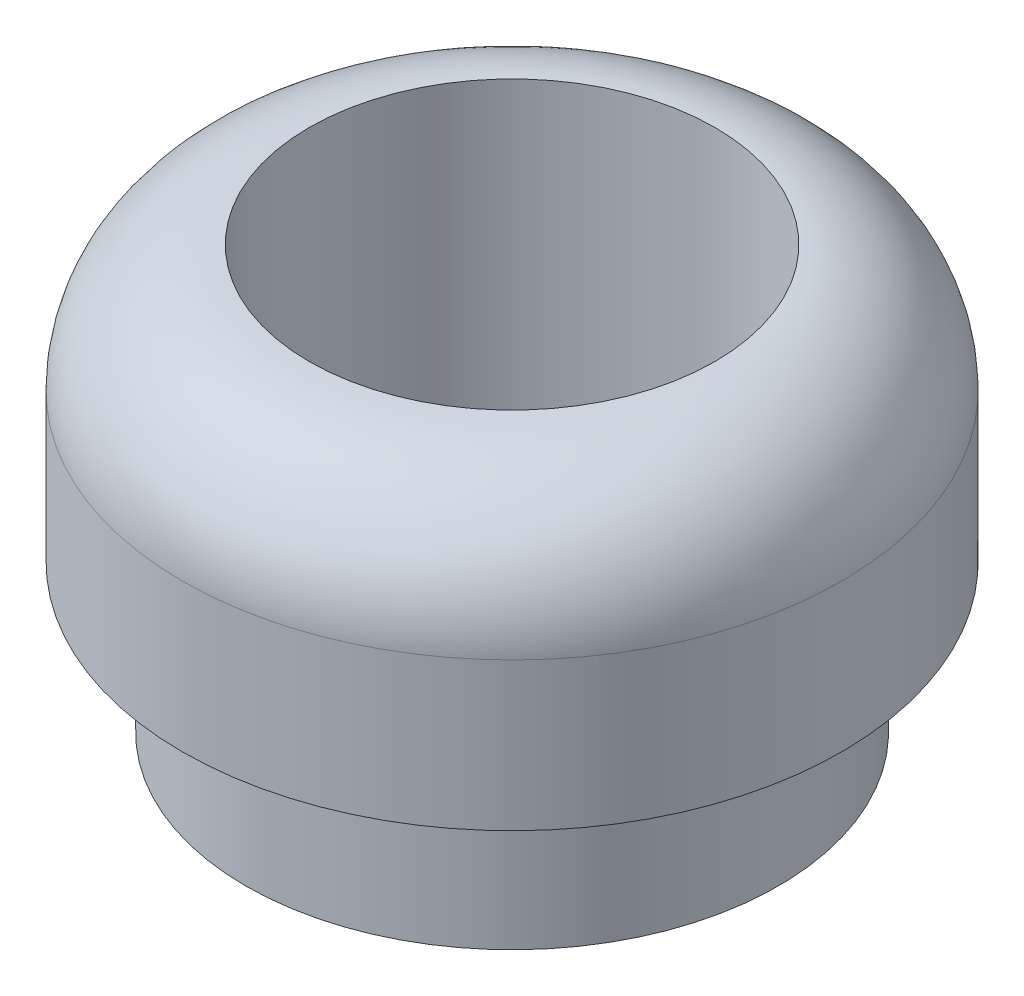
ISO-10303-21;
HEADER;
FILE_DESCRIPTION(('STEP AP214'),'2;1');
FILE_NAME('part.step','',(''),(''),'','','');
FILE_SCHEMA(('AUTOMOTIVE_DESIGN { 1 0 10303 214 1 1 1 1 }'));
ENDSEC;
DATA;
#1=APPLICATION_CONTEXT('core data for automotive mechanical design processes');
#2=APPLICATION_PROTOCOL_DEFINITION('international standard','automotive_design',2000,#1);
#3=PRODUCT_CONTEXT('',#1,'mechanical');
#4=PRODUCT('Part','Part','',(#3));
#5=PRODUCT_RELATED_PRODUCT_CATEGORY('part','',(#4));
#6=PRODUCT_DEFINITION_FORMATION('','',#4);
#7=PRODUCT_DEFINITION_CONTEXT('part definition',#1,'design');
#8=PRODUCT_DEFINITION('design','',#6,#7);
#9=PRODUCT_DEFINITION_SHAPE('','',#8);
#10=(LENGTH_UNIT() NAMED_UNIT(*) SI_UNIT(.MILLI.,.METRE.));
#11=(NAMED_UNIT(*) PLANE_ANGLE_UNIT() SI_UNIT($,.RADIAN.));
#12=(NAMED_UNIT(*) SI_UNIT($,.STERADIAN.) SOLID_ANGLE_UNIT());
#13=UNCERTAINTY_MEASURE_WITH_UNIT(LENGTH_MEASURE(1.E-05),#10,'distance_accuracy_value','');
#14=(GEOMETRIC_REPRESENTATION_CONTEXT(3) GLOBAL_UNCERTAINTY_ASSIGNED_CONTEXT((#13)) GLOBAL_UNIT_ASSIGNED_CONTEXT((#10,
#11,#12)) REPRESENTATION_CONTEXT('',''));
#15=CARTESIAN_POINT('',(0.,0.,0.));
#16=DIRECTION('',(0.,0.,1.));
#17=DIRECTION('',(1.,0.,0.));
#18=AXIS2_PLACEMENT_3D('',#15,#16,#17);
#19=CARTESIAN_POINT('',(0.,7.,0.));
#20=DIRECTION('',(0.,1.,0.));
#21=DIRECTION('',(0.,0.,1.));
#22=AXIS2_PLACEMENT_3D('',#19,#20,#21);
#23=TOROIDAL_SURFACE('',#22,4.8,3.);
#24=CARTESIAN_POINT('',(0.,10.,0.));
#25=DIRECTION('',(0.,1.,0.));
#26=DIRECTION('',(0.,0.,1.));
#27=AXIS2_PLACEMENT_3D('',#24,#25,#26);
#28=CIRCLE('',#27,4.8);
#29=CARTESIAN_POINT('',(0.,10.,4.8));
#30=VERTEX_POINT('',#29);
#31=EDGE_CURVE('E56',#30,#30,#28,.T.);
#32=ORIENTED_EDGE('',*,*,#31,.F.);
#33=EDGE_LOOP('',(#32));
#34=FACE_BOUND('',#33,.T.);
#35=CARTESIAN_POINT('',(0.,7.,0.));
#36=DIRECTION('',(0.,1.,0.));
#37=DIRECTION('',(0.,0.,1.));
#38=AXIS2_PLACEMENT_3D('',#35,#36,#37);
#39=CIRCLE('',#38,7.8);
#40=CARTESIAN_POINT('',(0.,7.,7.8));
#41=VERTEX_POINT('',#40);
#42=EDGE_CURVE('E12',#41,#41,#39,.F.);
#43=ORIENTED_EDGE('',*,*,#42,.F.);
#44=EDGE_LOOP('',(#43));
#45=FACE_BOUND('',#44,.T.);
#46=ADVANCED_FACE('F46',(#34,#45),#23,.T.);
#47=CARTESIAN_POINT('',(0.,10.,0.));
#48=DIRECTION('',(0.,-1.,0.));
#49=DIRECTION('',(0.,0.,-1.));
#50=AXIS2_PLACEMENT_3D('',#47,#48,#49);
#51=CYLINDRICAL_SURFACE('',#50,7.8);
#52=ORIENTED_EDGE('',*,*,#42,.T.);
#53=EDGE_LOOP('',(#52));
#54=FACE_BOUND('',#53,.T.);
#55=CARTESIAN_POINT('',(0.,3.5,0.));
#56=DIRECTION('',(0.,1.,0.));
#57=DIRECTION('',(0.,0.,1.));
#58=AXIS2_PLACEMENT_3D('',#55,#56,#57);
#59=CIRCLE('',#58,7.8);
#60=CARTESIAN_POINT('',(0.,3.5,7.8));
#61=VERTEX_POINT('',#60);
#62=EDGE_CURVE('E65',#61,#61,#59,.T.);
#63=ORIENTED_EDGE('',*,*,#62,.T.);
#64=EDGE_LOOP('',(#63));
#65=FACE_BOUND('',#64,.T.);
#66=ADVANCED_FACE('F100',(#54,#65),#51,.T.);
#67=CARTESIAN_POINT('',(0.,-13.5764501987817,0.));
#68=DIRECTION('',(0.,1.,0.));
#69=DIRECTION('',(0.,0.,1.));
#70=AXIS2_PLACEMENT_3D('',#67,#68,#69);
#71=CYLINDRICAL_SURFACE('',#70,4.8);
#72=CARTESIAN_POINT('',(0.,2.,0.));
#73=DIRECTION('',(0.,1.,0.));
#74=DIRECTION('',(0.,0.,1.));
#75=AXIS2_PLACEMENT_3D('',#72,#73,#74);
#76=CIRCLE('',#75,4.8);
#77=CARTESIAN_POINT('',(0.,2.,4.8));
#78=VERTEX_POINT('',#77);
#79=EDGE_CURVE('E52',#78,#78,#76,.F.);
#80=ORIENTED_EDGE('',*,*,#79,.T.);
#81=EDGE_LOOP('',(#80));
#82=FACE_BOUND('',#81,.T.);
#83=ORIENTED_EDGE('',*,*,#31,.T.);
#84=EDGE_LOOP('',(#83));
#85=FACE_BOUND('',#84,.T.);
#86=ADVANCED_FACE('F96',(#82,#85),#71,.F.);
#87=CARTESIAN_POINT('',(0.,2.,0.));
#88=DIRECTION('',(0.,1.,0.));
#89=DIRECTION('',(0.,0.,1.));
#90=AXIS2_PLACEMENT_3D('',#87,#88,#89);
#91=PLANE('',#90);
#92=CARTESIAN_POINT('',(0.,2.,0.));
#93=DIRECTION('',(0.,1.,0.));
#94=DIRECTION('',(0.,0.,1.));
#95=AXIS2_PLACEMENT_3D('',#92,#93,#94);
#96=CIRCLE('',#95,2.8);
#97=CARTESIAN_POINT('',(0.,2.,2.8));
#98=VERTEX_POINT('',#97);
#99=EDGE_CURVE('E61',#98,#98,#96,.F.);
#100=ORIENTED_EDGE('',*,*,#99,.T.);
#101=EDGE_LOOP('',(#100));
#102=FACE_BOUND('',#101,.T.);
#103=ORIENTED_EDGE('',*,*,#79,.F.);
#104=EDGE_LOOP('',(#103));
#105=FACE_BOUND('',#104,.T.);
#106=ADVANCED_FACE('F86',(#102,#105),#91,.T.);
#107=CARTESIAN_POINT('',(0.,3.5,0.));
#108=DIRECTION('',(0.,-1.,0.));
#109=DIRECTION('',(0.,0.,-1.));
#110=AXIS2_PLACEMENT_3D('',#107,#108,#109);
#111=CYLINDRICAL_SURFACE('',#110,2.8);
#112=ORIENTED_EDGE('',*,*,#99,.F.);
#113=EDGE_LOOP('',(#112));
#114=FACE_BOUND('',#113,.T.);
#115=CARTESIAN_POINT('',(0.,0.,0.));
#116=DIRECTION('',(0.,1.,0.));
#117=DIRECTION('',(0.,0.,1.));
#118=AXIS2_PLACEMENT_3D('',#115,#116,#117);
#119=CIRCLE('',#118,2.8);
#120=CARTESIAN_POINT('',(0.,0.,2.8));
#121=VERTEX_POINT('',#120);
#122=EDGE_CURVE('E78',#121,#121,#119,.T.);
#123=ORIENTED_EDGE('',*,*,#122,.F.);
#124=EDGE_LOOP('',(#123));
#125=FACE_BOUND('',#124,.T.);
#126=ADVANCED_FACE('F84',(#114,#125),#111,.F.);
#127=CARTESIAN_POINT('',(0.,0.,0.));
#128=DIRECTION('',(0.,1.,0.));
#129=DIRECTION('',(0.,0.,1.));
#130=AXIS2_PLACEMENT_3D('',#127,#128,#129);
#131=PLANE('',#130);
#132=CARTESIAN_POINT('',(0.,0.,0.));
#133=DIRECTION('',(0.,1.,0.));
#134=DIRECTION('',(0.,0.,1.));
#135=AXIS2_PLACEMENT_3D('',#132,#133,#134);
#136=CIRCLE('',#135,6.3);
#137=CARTESIAN_POINT('',(0.,0.,6.3));
#138=VERTEX_POINT('',#137);
#139=EDGE_CURVE('E73',#138,#138,#136,.T.);
#140=ORIENTED_EDGE('',*,*,#139,.F.);
#141=EDGE_LOOP('',(#140));
#142=FACE_BOUND('',#141,.T.);
#143=ORIENTED_EDGE('',*,*,#122,.T.);
#144=EDGE_LOOP('',(#143));
#145=FACE_BOUND('',#144,.T.);
#146=ADVANCED_FACE('F82',(#142,#145),#131,.F.);
#147=CARTESIAN_POINT('',(0.,3.5,0.));
#148=DIRECTION('',(0.,-1.,0.));
#149=DIRECTION('',(0.,0.,-1.));
#150=AXIS2_PLACEMENT_3D('',#147,#148,#149);
#151=CYLINDRICAL_SURFACE('',#150,6.3);
#152=CARTESIAN_POINT('',(0.,3.5,0.));
#153=DIRECTION('',(0.,1.,0.));
#154=DIRECTION('',(0.,0.,1.));
#155=AXIS2_PLACEMENT_3D('',#152,#153,#154);
#156=CIRCLE('',#155,6.3);
#157=CARTESIAN_POINT('',(0.,3.5,6.3));
#158=VERTEX_POINT('',#157);
#159=EDGE_CURVE('E69',#158,#158,#156,.T.);
#160=ORIENTED_EDGE('',*,*,#159,.F.);
#161=EDGE_LOOP('',(#160));
#162=FACE_BOUND('',#161,.T.);
#163=ORIENTED_EDGE('',*,*,#139,.T.);
#164=EDGE_LOOP('',(#163));
#165=FACE_BOUND('',#164,.T.);
#166=ADVANCED_FACE('F93',(#162,#165),#151,.T.);
#167=CARTESIAN_POINT('',(0.,3.5,0.));
#168=DIRECTION('',(0.,1.,0.));
#169=DIRECTION('',(0.,0.,1.));
#170=AXIS2_PLACEMENT_3D('',#167,#168,#169);
#171=PLANE('',#170);
#172=ORIENTED_EDGE('',*,*,#159,.T.);
#173=EDGE_LOOP('',(#172));
#174=FACE_BOUND('',#173,.T.);
#175=ORIENTED_EDGE('',*,*,#62,.F.);
#176=EDGE_LOOP('',(#175));
#177=FACE_BOUND('',#176,.T.);
#178=ADVANCED_FACE('F114',(#174,#177),#171,.F.);
#179=CLOSED_SHELL('',(#46,#66,#86,#106,#126,#146,#166,#178));
#180=MANIFOLD_SOLID_BREP('B2',#179);
#181=ADVANCED_BREP_SHAPE_REPRESENTATION('',(#18,#180),#14);
#182=SHAPE_DEFINITION_REPRESENTATION(#9,#181);
ENDSEC;
END-ISO-10303-21;
